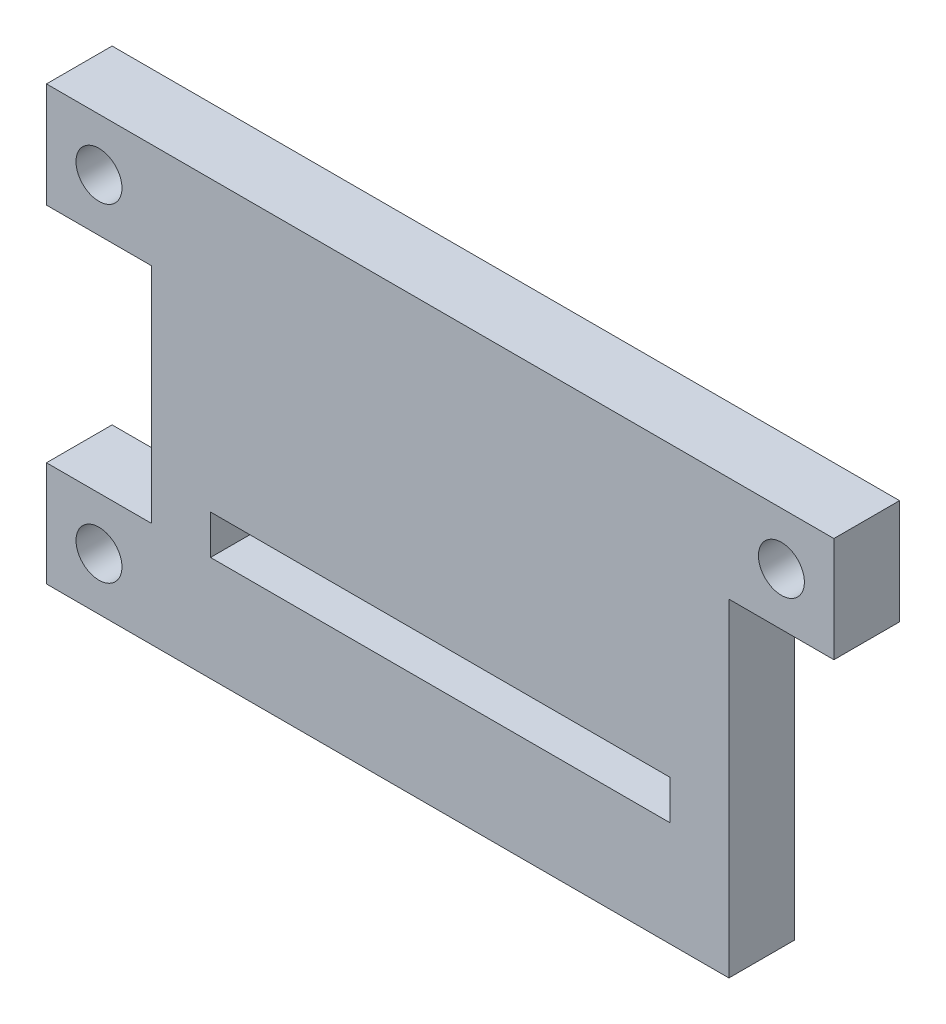
ISO-10303-21;
HEADER;
FILE_DESCRIPTION(('STEP AP214'),'2;1');
FILE_NAME('part.step','',(''),(''),'','','');
FILE_SCHEMA(('AUTOMOTIVE_DESIGN { 1 0 10303 214 1 1 1 1 }'));
ENDSEC;
DATA;
#1=APPLICATION_CONTEXT('core data for automotive mechanical design processes');
#2=APPLICATION_PROTOCOL_DEFINITION('international standard','automotive_design',2000,#1);
#3=PRODUCT_CONTEXT('',#1,'mechanical');
#4=PRODUCT('Part','Part','',(#3));
#5=PRODUCT_RELATED_PRODUCT_CATEGORY('part','',(#4));
#6=PRODUCT_DEFINITION_FORMATION('','',#4);
#7=PRODUCT_DEFINITION_CONTEXT('part definition',#1,'design');
#8=PRODUCT_DEFINITION('design','',#6,#7);
#9=PRODUCT_DEFINITION_SHAPE('','',#8);
#10=(LENGTH_UNIT() NAMED_UNIT(*) SI_UNIT(.MILLI.,.METRE.));
#11=(NAMED_UNIT(*) PLANE_ANGLE_UNIT() SI_UNIT($,.RADIAN.));
#12=(NAMED_UNIT(*) SI_UNIT($,.STERADIAN.) SOLID_ANGLE_UNIT());
#13=UNCERTAINTY_MEASURE_WITH_UNIT(LENGTH_MEASURE(1.E-05),#10,'distance_accuracy_value','');
#14=(GEOMETRIC_REPRESENTATION_CONTEXT(3) GLOBAL_UNCERTAINTY_ASSIGNED_CONTEXT((#13)) GLOBAL_UNIT_ASSIGNED_CONTEXT((#10,
#11,#12)) REPRESENTATION_CONTEXT('',''));
#15=CARTESIAN_POINT('',(0.,0.,0.));
#16=DIRECTION('',(0.,0.,1.));
#17=DIRECTION('',(1.,0.,0.));
#18=AXIS2_PLACEMENT_3D('',#15,#16,#17);
#19=CARTESIAN_POINT('',(0.,-16.5,5.));
#20=DIRECTION('',(0.,1.,0.));
#21=DIRECTION('',(0.,0.,1.));
#22=AXIS2_PLACEMENT_3D('',#19,#20,#21);
#23=PLANE('',#22);
#24=DIRECTION('',(0.,0.,-1.));
#25=VECTOR('',#24,1.);
#26=CARTESIAN_POINT('',(22.,-16.5,5.));
#27=LINE('',#26,#25);
#28=CARTESIAN_POINT('',(22.,-16.5,5.));
#29=VERTEX_POINT('',#28);
#30=CARTESIAN_POINT('',(22.,-16.5,0.));
#31=VERTEX_POINT('',#30);
#32=EDGE_CURVE('E138',#29,#31,#27,.T.);
#33=ORIENTED_EDGE('',*,*,#32,.F.);
#34=DIRECTION('',(1.,0.,0.));
#35=VECTOR('',#34,1.);
#36=CARTESIAN_POINT('',(0.,-16.5,5.));
#37=LINE('',#36,#35);
#38=CARTESIAN_POINT('',(-30.,-16.5,5.));
#39=VERTEX_POINT('',#38);
#40=EDGE_CURVE('E146',#39,#29,#37,.T.);
#41=ORIENTED_EDGE('',*,*,#40,.F.);
#42=DIRECTION('',(0.,0.,-1.));
#43=VECTOR('',#42,1.);
#44=CARTESIAN_POINT('',(-30.,-16.5,5.));
#45=LINE('',#44,#43);
#46=CARTESIAN_POINT('',(-30.,-16.5,0.));
#47=VERTEX_POINT('',#46);
#48=EDGE_CURVE('E214',#39,#47,#45,.T.);
#49=ORIENTED_EDGE('',*,*,#48,.T.);
#50=DIRECTION('',(1.,0.,0.));
#51=VECTOR('',#50,1.);
#52=CARTESIAN_POINT('',(0.,-16.5,0.));
#53=LINE('',#52,#51);
#54=EDGE_CURVE('E151',#47,#31,#53,.T.);
#55=ORIENTED_EDGE('',*,*,#54,.T.);
#56=EDGE_LOOP('',(#33,#41,#49,#55));
#57=FACE_BOUND('',#56,.T.);
#58=ADVANCED_FACE('F35',(#57),#23,.F.);
#59=CARTESIAN_POINT('',(0.,0.,5.));
#60=DIRECTION('',(0.,0.,1.));
#61=DIRECTION('',(1.,0.,0.));
#62=AXIS2_PLACEMENT_3D('',#59,#60,#61);
#63=PLANE('',#62);
#64=CARTESIAN_POINT('',(26.,12.5,5.));
#65=DIRECTION('',(0.,0.,1.));
#66=DIRECTION('',(1.,0.,0.));
#67=AXIS2_PLACEMENT_3D('',#64,#65,#66);
#68=CIRCLE('',#67,1.75);
#69=CARTESIAN_POINT('',(27.75,12.5,5.));
#70=VERTEX_POINT('',#69);
#71=EDGE_CURVE('E170',#70,#70,#68,.T.);
#72=ORIENTED_EDGE('',*,*,#71,.F.);
#73=EDGE_LOOP('',(#72));
#74=FACE_BOUND('',#73,.T.);
#75=CARTESIAN_POINT('',(-26.,-12.5,5.));
#76=DIRECTION('',(0.,0.,1.));
#77=DIRECTION('',(1.,0.,0.));
#78=AXIS2_PLACEMENT_3D('',#75,#76,#77);
#79=CIRCLE('',#78,1.75);
#80=CARTESIAN_POINT('',(-24.25,-12.5,5.));
#81=VERTEX_POINT('',#80);
#82=EDGE_CURVE('E167',#81,#81,#79,.T.);
#83=ORIENTED_EDGE('',*,*,#82,.F.);
#84=EDGE_LOOP('',(#83));
#85=FACE_BOUND('',#84,.T.);
#86=CARTESIAN_POINT('',(-26.,12.5,5.));
#87=DIRECTION('',(0.,0.,1.));
#88=DIRECTION('',(1.,0.,0.));
#89=AXIS2_PLACEMENT_3D('',#86,#87,#88);
#90=CIRCLE('',#89,1.75);
#91=CARTESIAN_POINT('',(-24.25,12.5,5.));
#92=VERTEX_POINT('',#91);
#93=EDGE_CURVE('E209',#92,#92,#90,.T.);
#94=ORIENTED_EDGE('',*,*,#93,.F.);
#95=EDGE_LOOP('',(#94));
#96=FACE_BOUND('',#95,.T.);
#97=DIRECTION('',(0.,1.,0.));
#98=VECTOR('',#97,1.);
#99=CARTESIAN_POINT('',(17.5,-5.49999999999999,5.));
#100=LINE('',#99,#98);
#101=CARTESIAN_POINT('',(17.5,-8.49999999999999,5.));
#102=VERTEX_POINT('',#101);
#103=CARTESIAN_POINT('',(17.5,-5.49999999999999,5.));
#104=VERTEX_POINT('',#103);
#105=EDGE_CURVE('E58',#102,#104,#100,.T.);
#106=ORIENTED_EDGE('',*,*,#105,.F.);
#107=DIRECTION('',(1.,0.,0.));
#108=VECTOR('',#107,1.);
#109=CARTESIAN_POINT('',(-17.5,-8.49999999999999,5.));
#110=LINE('',#109,#108);
#111=CARTESIAN_POINT('',(-17.5,-8.49999999999999,5.));
#112=VERTEX_POINT('',#111);
#113=EDGE_CURVE('E340',#112,#102,#110,.T.);
#114=ORIENTED_EDGE('',*,*,#113,.F.);
#115=DIRECTION('',(0.,-1.,0.));
#116=VECTOR('',#115,1.);
#117=CARTESIAN_POINT('',(-17.5,-5.49999999999999,5.));
#118=LINE('',#117,#116);
#119=CARTESIAN_POINT('',(-17.5,-5.49999999999999,5.));
#120=VERTEX_POINT('',#119);
#121=EDGE_CURVE('E338',#120,#112,#118,.T.);
#122=ORIENTED_EDGE('',*,*,#121,.F.);
#123=DIRECTION('',(-1.,0.,0.));
#124=VECTOR('',#123,1.);
#125=CARTESIAN_POINT('',(-17.5,-5.49999999999999,5.));
#126=LINE('',#125,#124);
#127=EDGE_CURVE('E335',#104,#120,#126,.T.);
#128=ORIENTED_EDGE('',*,*,#127,.F.);
#129=EDGE_LOOP('',(#106,#114,#122,#128));
#130=FACE_BOUND('',#129,.T.);
#131=ORIENTED_EDGE('',*,*,#40,.T.);
#132=DIRECTION('',(0.,-1.,0.));
#133=VECTOR('',#132,1.);
#134=CARTESIAN_POINT('',(22.,0.,5.));
#135=LINE('',#134,#133);
#136=CARTESIAN_POINT('',(22.,8.5,5.));
#137=VERTEX_POINT('',#136);
#138=EDGE_CURVE('E135',#137,#29,#135,.T.);
#139=ORIENTED_EDGE('',*,*,#138,.F.);
#140=DIRECTION('',(-1.,0.,0.));
#141=VECTOR('',#140,1.);
#142=CARTESIAN_POINT('',(0.,8.49999999999999,5.));
#143=LINE('',#142,#141);
#144=CARTESIAN_POINT('',(30.,8.5,5.));
#145=VERTEX_POINT('',#144);
#146=EDGE_CURVE('E145',#145,#137,#143,.T.);
#147=ORIENTED_EDGE('',*,*,#146,.F.);
#148=DIRECTION('',(0.,1.,0.));
#149=VECTOR('',#148,1.);
#150=CARTESIAN_POINT('',(30.,0.,5.));
#151=LINE('',#150,#149);
#152=CARTESIAN_POINT('',(30.,16.5,5.));
#153=VERTEX_POINT('',#152);
#154=EDGE_CURVE('E165',#145,#153,#151,.T.);
#155=ORIENTED_EDGE('',*,*,#154,.T.);
#156=DIRECTION('',(1.,0.,0.));
#157=VECTOR('',#156,1.);
#158=CARTESIAN_POINT('',(0.,16.5,5.));
#159=LINE('',#158,#157);
#160=CARTESIAN_POINT('',(-30.,16.5,5.));
#161=VERTEX_POINT('',#160);
#162=EDGE_CURVE('E248',#161,#153,#159,.T.);
#163=ORIENTED_EDGE('',*,*,#162,.F.);
#164=DIRECTION('',(0.,1.,0.));
#165=VECTOR('',#164,1.);
#166=CARTESIAN_POINT('',(-30.,0.,5.));
#167=LINE('',#166,#165);
#168=CARTESIAN_POINT('',(-30.,8.5,5.));
#169=VERTEX_POINT('',#168);
#170=EDGE_CURVE('E236',#169,#161,#167,.T.);
#171=ORIENTED_EDGE('',*,*,#170,.F.);
#172=DIRECTION('',(1.,0.,0.));
#173=VECTOR('',#172,1.);
#174=CARTESIAN_POINT('',(0.,8.5,5.));
#175=LINE('',#174,#173);
#176=CARTESIAN_POINT('',(-22.,8.5,5.));
#177=VERTEX_POINT('',#176);
#178=EDGE_CURVE('E228',#169,#177,#175,.T.);
#179=ORIENTED_EDGE('',*,*,#178,.T.);
#180=DIRECTION('',(0.,-1.,0.));
#181=VECTOR('',#180,1.);
#182=CARTESIAN_POINT('',(-22.,0.,5.));
#183=LINE('',#182,#181);
#184=CARTESIAN_POINT('',(-22.,-8.49999999999999,5.));
#185=VERTEX_POINT('',#184);
#186=EDGE_CURVE('E257',#177,#185,#183,.T.);
#187=ORIENTED_EDGE('',*,*,#186,.T.);
#188=DIRECTION('',(1.,0.,0.));
#189=VECTOR('',#188,1.);
#190=CARTESIAN_POINT('',(0.,-8.49999999999999,5.));
#191=LINE('',#190,#189);
#192=CARTESIAN_POINT('',(-30.,-8.49999999999999,5.));
#193=VERTEX_POINT('',#192);
#194=EDGE_CURVE('E160',#193,#185,#191,.T.);
#195=ORIENTED_EDGE('',*,*,#194,.F.);
#196=DIRECTION('',(0.,-1.,0.));
#197=VECTOR('',#196,1.);
#198=CARTESIAN_POINT('',(-30.,0.,5.));
#199=LINE('',#198,#197);
#200=EDGE_CURVE('E157',#193,#39,#199,.T.);
#201=ORIENTED_EDGE('',*,*,#200,.T.);
#202=EDGE_LOOP('',(#131,#139,#147,#155,#163,#171,#179,#187,#195,#201));
#203=FACE_BOUND('',#202,.T.);
#204=ADVANCED_FACE('F154',(#74,#85,#96,#130,#203),#63,.T.);
#205=CARTESIAN_POINT('',(0.,0.,0.));
#206=DIRECTION('',(0.,0.,1.));
#207=DIRECTION('',(1.,0.,0.));
#208=AXIS2_PLACEMENT_3D('',#205,#206,#207);
#209=PLANE('',#208);
#210=CARTESIAN_POINT('',(26.,12.5,0.));
#211=DIRECTION('',(0.,0.,1.));
#212=DIRECTION('',(1.,0.,0.));
#213=AXIS2_PLACEMENT_3D('',#210,#211,#212);
#214=CIRCLE('',#213,1.75);
#215=CARTESIAN_POINT('',(27.75,12.5,0.));
#216=VERTEX_POINT('',#215);
#217=EDGE_CURVE('E206',#216,#216,#214,.T.);
#218=ORIENTED_EDGE('',*,*,#217,.T.);
#219=EDGE_LOOP('',(#218));
#220=FACE_BOUND('',#219,.T.);
#221=CARTESIAN_POINT('',(-26.,-12.5,0.));
#222=DIRECTION('',(0.,0.,1.));
#223=DIRECTION('',(1.,0.,0.));
#224=AXIS2_PLACEMENT_3D('',#221,#222,#223);
#225=CIRCLE('',#224,1.75);
#226=CARTESIAN_POINT('',(-24.25,-12.5,0.));
#227=VERTEX_POINT('',#226);
#228=EDGE_CURVE('E203',#227,#227,#225,.T.);
#229=ORIENTED_EDGE('',*,*,#228,.T.);
#230=EDGE_LOOP('',(#229));
#231=FACE_BOUND('',#230,.T.);
#232=CARTESIAN_POINT('',(-26.,12.5,0.));
#233=DIRECTION('',(0.,0.,1.));
#234=DIRECTION('',(1.,0.,0.));
#235=AXIS2_PLACEMENT_3D('',#232,#233,#234);
#236=CIRCLE('',#235,1.75);
#237=CARTESIAN_POINT('',(-24.25,12.5,0.));
#238=VERTEX_POINT('',#237);
#239=EDGE_CURVE('E174',#238,#238,#236,.T.);
#240=ORIENTED_EDGE('',*,*,#239,.T.);
#241=EDGE_LOOP('',(#240));
#242=FACE_BOUND('',#241,.T.);
#243=DIRECTION('',(-1.,0.,0.));
#244=VECTOR('',#243,1.);
#245=CARTESIAN_POINT('',(-17.5,-8.49999999999999,0.));
#246=LINE('',#245,#244);
#247=CARTESIAN_POINT('',(17.5,-8.49999999999999,0.));
#248=VERTEX_POINT('',#247);
#249=CARTESIAN_POINT('',(-17.5,-8.49999999999999,0.));
#250=VERTEX_POINT('',#249);
#251=EDGE_CURVE('E317',#248,#250,#246,.T.);
#252=ORIENTED_EDGE('',*,*,#251,.F.);
#253=DIRECTION('',(0.,-1.,0.));
#254=VECTOR('',#253,1.);
#255=CARTESIAN_POINT('',(17.5,-5.49999999999999,0.));
#256=LINE('',#255,#254);
#257=CARTESIAN_POINT('',(17.5,-5.49999999999999,0.));
#258=VERTEX_POINT('',#257);
#259=EDGE_CURVE('E326',#258,#248,#256,.T.);
#260=ORIENTED_EDGE('',*,*,#259,.F.);
#261=DIRECTION('',(1.,0.,0.));
#262=VECTOR('',#261,1.);
#263=CARTESIAN_POINT('',(-17.5,-5.49999999999999,0.));
#264=LINE('',#263,#262);
#265=CARTESIAN_POINT('',(-17.5,-5.49999999999999,0.));
#266=VERTEX_POINT('',#265);
#267=EDGE_CURVE('E178',#266,#258,#264,.T.);
#268=ORIENTED_EDGE('',*,*,#267,.F.);
#269=DIRECTION('',(0.,1.,0.));
#270=VECTOR('',#269,1.);
#271=CARTESIAN_POINT('',(-17.5,-5.49999999999999,0.));
#272=LINE('',#271,#270);
#273=EDGE_CURVE('E152',#250,#266,#272,.T.);
#274=ORIENTED_EDGE('',*,*,#273,.F.);
#275=EDGE_LOOP('',(#252,#260,#268,#274));
#276=FACE_BOUND('',#275,.T.);
#277=DIRECTION('',(0.,-1.,0.));
#278=VECTOR('',#277,1.);
#279=CARTESIAN_POINT('',(22.,0.,0.));
#280=LINE('',#279,#278);
#281=CARTESIAN_POINT('',(22.,8.5,0.));
#282=VERTEX_POINT('',#281);
#283=EDGE_CURVE('E50',#282,#31,#280,.T.);
#284=ORIENTED_EDGE('',*,*,#283,.T.);
#285=ORIENTED_EDGE('',*,*,#54,.F.);
#286=DIRECTION('',(0.,-1.,0.));
#287=VECTOR('',#286,1.);
#288=CARTESIAN_POINT('',(-30.,0.,0.));
#289=LINE('',#288,#287);
#290=CARTESIAN_POINT('',(-30.,-8.49999999999999,0.));
#291=VERTEX_POINT('',#290);
#292=EDGE_CURVE('E193',#291,#47,#289,.T.);
#293=ORIENTED_EDGE('',*,*,#292,.F.);
#294=DIRECTION('',(1.,0.,0.));
#295=VECTOR('',#294,1.);
#296=CARTESIAN_POINT('',(0.,-8.49999999999999,0.));
#297=LINE('',#296,#295);
#298=CARTESIAN_POINT('',(-22.,-8.49999999999999,0.));
#299=VERTEX_POINT('',#298);
#300=EDGE_CURVE('E190',#291,#299,#297,.T.);
#301=ORIENTED_EDGE('',*,*,#300,.T.);
#302=DIRECTION('',(0.,-1.,0.));
#303=VECTOR('',#302,1.);
#304=CARTESIAN_POINT('',(-22.,0.,0.));
#305=LINE('',#304,#303);
#306=CARTESIAN_POINT('',(-22.,8.5,0.));
#307=VERTEX_POINT('',#306);
#308=EDGE_CURVE('E187',#307,#299,#305,.T.);
#309=ORIENTED_EDGE('',*,*,#308,.F.);
#310=DIRECTION('',(1.,0.,0.));
#311=VECTOR('',#310,1.);
#312=CARTESIAN_POINT('',(0.,8.5,0.));
#313=LINE('',#312,#311);
#314=CARTESIAN_POINT('',(-30.,8.5,0.));
#315=VERTEX_POINT('',#314);
#316=EDGE_CURVE('E184',#315,#307,#313,.T.);
#317=ORIENTED_EDGE('',*,*,#316,.F.);
#318=DIRECTION('',(0.,1.,0.));
#319=VECTOR('',#318,1.);
#320=CARTESIAN_POINT('',(-30.,0.,0.));
#321=LINE('',#320,#319);
#322=CARTESIAN_POINT('',(-30.,16.5,0.));
#323=VERTEX_POINT('',#322);
#324=EDGE_CURVE('E181',#315,#323,#321,.T.);
#325=ORIENTED_EDGE('',*,*,#324,.T.);
#326=DIRECTION('',(1.,0.,0.));
#327=VECTOR('',#326,1.);
#328=CARTESIAN_POINT('',(0.,16.5,0.));
#329=LINE('',#328,#327);
#330=CARTESIAN_POINT('',(30.,16.5,0.));
#331=VERTEX_POINT('',#330);
#332=EDGE_CURVE('E177',#323,#331,#329,.T.);
#333=ORIENTED_EDGE('',*,*,#332,.T.);
#334=DIRECTION('',(0.,1.,0.));
#335=VECTOR('',#334,1.);
#336=CARTESIAN_POINT('',(30.,0.,0.));
#337=LINE('',#336,#335);
#338=CARTESIAN_POINT('',(30.,8.5,0.));
#339=VERTEX_POINT('',#338);
#340=EDGE_CURVE('E200',#339,#331,#337,.T.);
#341=ORIENTED_EDGE('',*,*,#340,.F.);
#342=DIRECTION('',(-1.,0.,0.));
#343=VECTOR('',#342,1.);
#344=CARTESIAN_POINT('',(0.,8.49999999999999,0.));
#345=LINE('',#344,#343);
#346=EDGE_CURVE('E198',#339,#282,#345,.T.);
#347=ORIENTED_EDGE('',*,*,#346,.T.);
#348=EDGE_LOOP('',(#284,#285,#293,#301,#309,#317,#325,#333,#341,#347));
#349=FACE_BOUND('',#348,.T.);
#350=ADVANCED_FACE('F233',(#220,#231,#242,#276,#349),#209,.F.);
#351=CARTESIAN_POINT('',(0.,16.5,5.));
#352=DIRECTION('',(0.,1.,0.));
#353=DIRECTION('',(0.,0.,1.));
#354=AXIS2_PLACEMENT_3D('',#351,#352,#353);
#355=PLANE('',#354);
#356=ORIENTED_EDGE('',*,*,#332,.F.);
#357=DIRECTION('',(0.,0.,-1.));
#358=VECTOR('',#357,1.);
#359=CARTESIAN_POINT('',(-30.,16.5,5.));
#360=LINE('',#359,#358);
#361=EDGE_CURVE('E11',#161,#323,#360,.T.);
#362=ORIENTED_EDGE('',*,*,#361,.F.);
#363=ORIENTED_EDGE('',*,*,#162,.T.);
#364=DIRECTION('',(0.,0.,-1.));
#365=VECTOR('',#364,1.);
#366=CARTESIAN_POINT('',(30.,16.5,5.));
#367=LINE('',#366,#365);
#368=EDGE_CURVE('E173',#153,#331,#367,.T.);
#369=ORIENTED_EDGE('',*,*,#368,.T.);
#370=EDGE_LOOP('',(#356,#362,#363,#369));
#371=FACE_BOUND('',#370,.T.);
#372=ADVANCED_FACE('F240',(#371),#355,.T.);
#373=CARTESIAN_POINT('',(-30.,0.,5.));
#374=DIRECTION('',(-1.,0.,0.));
#375=DIRECTION('',(0.,-1.,0.));
#376=AXIS2_PLACEMENT_3D('',#373,#374,#375);
#377=PLANE('',#376);
#378=ORIENTED_EDGE('',*,*,#324,.F.);
#379=DIRECTION('',(0.,0.,-1.));
#380=VECTOR('',#379,1.);
#381=CARTESIAN_POINT('',(-30.,8.5,5.));
#382=LINE('',#381,#380);
#383=EDGE_CURVE('E43',#169,#315,#382,.T.);
#384=ORIENTED_EDGE('',*,*,#383,.F.);
#385=ORIENTED_EDGE('',*,*,#170,.T.);
#386=ORIENTED_EDGE('',*,*,#361,.T.);
#387=EDGE_LOOP('',(#378,#384,#385,#386));
#388=FACE_BOUND('',#387,.T.);
#389=ADVANCED_FACE('F234',(#388),#377,.T.);
#390=CARTESIAN_POINT('',(0.,8.5,5.));
#391=DIRECTION('',(0.,1.,0.));
#392=DIRECTION('',(0.,0.,1.));
#393=AXIS2_PLACEMENT_3D('',#390,#391,#392);
#394=PLANE('',#393);
#395=ORIENTED_EDGE('',*,*,#316,.T.);
#396=DIRECTION('',(0.,0.,-1.));
#397=VECTOR('',#396,1.);
#398=CARTESIAN_POINT('',(-22.,8.5,5.));
#399=LINE('',#398,#397);
#400=EDGE_CURVE('E220',#177,#307,#399,.T.);
#401=ORIENTED_EDGE('',*,*,#400,.F.);
#402=ORIENTED_EDGE('',*,*,#178,.F.);
#403=ORIENTED_EDGE('',*,*,#383,.T.);
#404=EDGE_LOOP('',(#395,#401,#402,#403));
#405=FACE_BOUND('',#404,.T.);
#406=ADVANCED_FACE('F225',(#405),#394,.F.);
#407=CARTESIAN_POINT('',(-22.,0.,5.));
#408=DIRECTION('',(1.,0.,0.));
#409=DIRECTION('',(0.,0.,-1.));
#410=AXIS2_PLACEMENT_3D('',#407,#408,#409);
#411=PLANE('',#410);
#412=ORIENTED_EDGE('',*,*,#308,.T.);
#413=DIRECTION('',(0.,0.,-1.));
#414=VECTOR('',#413,1.);
#415=CARTESIAN_POINT('',(-22.,-8.49999999999999,5.));
#416=LINE('',#415,#414);
#417=EDGE_CURVE('E218',#185,#299,#416,.T.);
#418=ORIENTED_EDGE('',*,*,#417,.F.);
#419=ORIENTED_EDGE('',*,*,#186,.F.);
#420=ORIENTED_EDGE('',*,*,#400,.T.);
#421=EDGE_LOOP('',(#412,#418,#419,#420));
#422=FACE_BOUND('',#421,.T.);
#423=ADVANCED_FACE('F264',(#422),#411,.F.);
#424=CARTESIAN_POINT('',(0.,-8.49999999999999,5.));
#425=DIRECTION('',(0.,1.,0.));
#426=DIRECTION('',(0.,0.,1.));
#427=AXIS2_PLACEMENT_3D('',#424,#425,#426);
#428=PLANE('',#427);
#429=ORIENTED_EDGE('',*,*,#300,.F.);
#430=DIRECTION('',(0.,0.,-1.));
#431=VECTOR('',#430,1.);
#432=CARTESIAN_POINT('',(-30.,-8.49999999999999,5.));
#433=LINE('',#432,#431);
#434=EDGE_CURVE('E216',#193,#291,#433,.T.);
#435=ORIENTED_EDGE('',*,*,#434,.F.);
#436=ORIENTED_EDGE('',*,*,#194,.T.);
#437=ORIENTED_EDGE('',*,*,#417,.T.);
#438=EDGE_LOOP('',(#429,#435,#436,#437));
#439=FACE_BOUND('',#438,.T.);
#440=ADVANCED_FACE('F261',(#439),#428,.T.);
#441=CARTESIAN_POINT('',(-30.,0.,5.));
#442=DIRECTION('',(1.,0.,0.));
#443=DIRECTION('',(0.,1.,0.));
#444=AXIS2_PLACEMENT_3D('',#441,#442,#443);
#445=PLANE('',#444);
#446=ORIENTED_EDGE('',*,*,#292,.T.);
#447=ORIENTED_EDGE('',*,*,#48,.F.);
#448=ORIENTED_EDGE('',*,*,#200,.F.);
#449=ORIENTED_EDGE('',*,*,#434,.T.);
#450=EDGE_LOOP('',(#446,#447,#448,#449));
#451=FACE_BOUND('',#450,.T.);
#452=ADVANCED_FACE('F267',(#451),#445,.F.);
#453=CARTESIAN_POINT('',(22.,0.,5.));
#454=DIRECTION('',(1.,0.,0.));
#455=DIRECTION('',(0.,0.,-1.));
#456=AXIS2_PLACEMENT_3D('',#453,#454,#455);
#457=PLANE('',#456);
#458=ORIENTED_EDGE('',*,*,#283,.F.);
#459=DIRECTION('',(0.,0.,-1.));
#460=VECTOR('',#459,1.);
#461=CARTESIAN_POINT('',(22.,8.5,5.));
#462=LINE('',#461,#460);
#463=EDGE_CURVE('E140',#137,#282,#462,.T.);
#464=ORIENTED_EDGE('',*,*,#463,.F.);
#465=ORIENTED_EDGE('',*,*,#138,.T.);
#466=ORIENTED_EDGE('',*,*,#32,.T.);
#467=EDGE_LOOP('',(#458,#464,#465,#466));
#468=FACE_BOUND('',#467,.T.);
#469=ADVANCED_FACE('F137',(#468),#457,.T.);
#470=CARTESIAN_POINT('',(0.,8.49999999999999,5.));
#471=DIRECTION('',(0.,-1.,0.));
#472=DIRECTION('',(1.,0.,0.));
#473=AXIS2_PLACEMENT_3D('',#470,#471,#472);
#474=PLANE('',#473);
#475=ORIENTED_EDGE('',*,*,#346,.F.);
#476=DIRECTION('',(0.,0.,-1.));
#477=VECTOR('',#476,1.);
#478=CARTESIAN_POINT('',(30.,8.5,5.));
#479=LINE('',#478,#477);
#480=EDGE_CURVE('E211',#145,#339,#479,.T.);
#481=ORIENTED_EDGE('',*,*,#480,.F.);
#482=ORIENTED_EDGE('',*,*,#146,.T.);
#483=ORIENTED_EDGE('',*,*,#463,.T.);
#484=EDGE_LOOP('',(#475,#481,#482,#483));
#485=FACE_BOUND('',#484,.T.);
#486=ADVANCED_FACE('F246',(#485),#474,.T.);
#487=CARTESIAN_POINT('',(-26.,-12.5,5.));
#488=DIRECTION('',(0.,0.,-1.));
#489=DIRECTION('',(-1.,0.,0.));
#490=AXIS2_PLACEMENT_3D('',#487,#488,#489);
#491=CYLINDRICAL_SURFACE('',#490,1.75);
#492=ORIENTED_EDGE('',*,*,#82,.T.);
#493=EDGE_LOOP('',(#492));
#494=FACE_BOUND('',#493,.T.);
#495=ORIENTED_EDGE('',*,*,#228,.F.);
#496=EDGE_LOOP('',(#495));
#497=FACE_BOUND('',#496,.T.);
#498=ADVANCED_FACE('F286',(#494,#497),#491,.F.);
#499=CARTESIAN_POINT('',(30.,0.,5.));
#500=DIRECTION('',(-1.,0.,0.));
#501=DIRECTION('',(0.,0.,1.));
#502=AXIS2_PLACEMENT_3D('',#499,#500,#501);
#503=PLANE('',#502);
#504=ORIENTED_EDGE('',*,*,#340,.T.);
#505=ORIENTED_EDGE('',*,*,#368,.F.);
#506=ORIENTED_EDGE('',*,*,#154,.F.);
#507=ORIENTED_EDGE('',*,*,#480,.T.);
#508=EDGE_LOOP('',(#504,#505,#506,#507));
#509=FACE_BOUND('',#508,.T.);
#510=ADVANCED_FACE('F249',(#509),#503,.F.);
#511=CARTESIAN_POINT('',(-26.,12.5,5.));
#512=DIRECTION('',(0.,0.,-1.));
#513=DIRECTION('',(-1.,0.,0.));
#514=AXIS2_PLACEMENT_3D('',#511,#512,#513);
#515=CYLINDRICAL_SURFACE('',#514,1.75);
#516=ORIENTED_EDGE('',*,*,#93,.T.);
#517=EDGE_LOOP('',(#516));
#518=FACE_BOUND('',#517,.T.);
#519=ORIENTED_EDGE('',*,*,#239,.F.);
#520=EDGE_LOOP('',(#519));
#521=FACE_BOUND('',#520,.T.);
#522=ADVANCED_FACE('F37',(#518,#521),#515,.F.);
#523=CARTESIAN_POINT('',(26.,12.5,5.));
#524=DIRECTION('',(0.,0.,-1.));
#525=DIRECTION('',(-1.,0.,0.));
#526=AXIS2_PLACEMENT_3D('',#523,#524,#525);
#527=CYLINDRICAL_SURFACE('',#526,1.75);
#528=ORIENTED_EDGE('',*,*,#71,.T.);
#529=EDGE_LOOP('',(#528));
#530=FACE_BOUND('',#529,.T.);
#531=ORIENTED_EDGE('',*,*,#217,.F.);
#532=EDGE_LOOP('',(#531));
#533=FACE_BOUND('',#532,.T.);
#534=ADVANCED_FACE('F292',(#530,#533),#527,.F.);
#535=CARTESIAN_POINT('',(17.5,-5.49999999999999,-0.00100000000000013));
#536=DIRECTION('',(1.,0.,0.));
#537=DIRECTION('',(0.,0.,-1.));
#538=AXIS2_PLACEMENT_3D('',#535,#536,#537);
#539=PLANE('',#538);
#540=ORIENTED_EDGE('',*,*,#259,.T.);
#541=DIRECTION('',(0.,0.,1.));
#542=VECTOR('',#541,1.);
#543=CARTESIAN_POINT('',(17.5,-8.49999999999999,-0.00100000000000013));
#544=LINE('',#543,#542);
#545=EDGE_CURVE('E322',#248,#102,#544,.T.);
#546=ORIENTED_EDGE('',*,*,#545,.T.);
#547=ORIENTED_EDGE('',*,*,#105,.T.);
#548=DIRECTION('',(0.,0.,1.));
#549=VECTOR('',#548,1.);
#550=CARTESIAN_POINT('',(17.5,-5.49999999999999,-0.00100000000000013));
#551=LINE('',#550,#549);
#552=EDGE_CURVE('E342',#258,#104,#551,.T.);
#553=ORIENTED_EDGE('',*,*,#552,.F.);
#554=EDGE_LOOP('',(#540,#546,#547,#553));
#555=FACE_BOUND('',#554,.T.);
#556=ADVANCED_FACE('F295',(#555),#539,.F.);
#557=CARTESIAN_POINT('',(-17.5,-8.49999999999999,-0.00100000000000013));
#558=DIRECTION('',(0.,-1.,0.));
#559=DIRECTION('',(0.,0.,-1.));
#560=AXIS2_PLACEMENT_3D('',#557,#558,#559);
#561=PLANE('',#560);
#562=ORIENTED_EDGE('',*,*,#251,.T.);
#563=DIRECTION('',(0.,0.,1.));
#564=VECTOR('',#563,1.);
#565=CARTESIAN_POINT('',(-17.5,-8.49999999999999,-0.00100000000000013));
#566=LINE('',#565,#564);
#567=EDGE_CURVE('E320',#250,#112,#566,.T.);
#568=ORIENTED_EDGE('',*,*,#567,.T.);
#569=ORIENTED_EDGE('',*,*,#113,.T.);
#570=ORIENTED_EDGE('',*,*,#545,.F.);
#571=EDGE_LOOP('',(#562,#568,#569,#570));
#572=FACE_BOUND('',#571,.T.);
#573=ADVANCED_FACE('F302',(#572),#561,.F.);
#574=CARTESIAN_POINT('',(-17.5,-5.49999999999999,-0.00100000000000013));
#575=DIRECTION('',(-1.,0.,0.));
#576=DIRECTION('',(0.,0.,1.));
#577=AXIS2_PLACEMENT_3D('',#574,#575,#576);
#578=PLANE('',#577);
#579=ORIENTED_EDGE('',*,*,#273,.T.);
#580=DIRECTION('',(0.,0.,1.));
#581=VECTOR('',#580,1.);
#582=CARTESIAN_POINT('',(-17.5,-5.49999999999999,-0.00100000000000013));
#583=LINE('',#582,#581);
#584=EDGE_CURVE('E345',#266,#120,#583,.T.);
#585=ORIENTED_EDGE('',*,*,#584,.T.);
#586=ORIENTED_EDGE('',*,*,#121,.T.);
#587=ORIENTED_EDGE('',*,*,#567,.F.);
#588=EDGE_LOOP('',(#579,#585,#586,#587));
#589=FACE_BOUND('',#588,.T.);
#590=ADVANCED_FACE('F306',(#589),#578,.F.);
#591=CARTESIAN_POINT('',(-17.5,-5.49999999999999,-0.00100000000000013));
#592=DIRECTION('',(0.,1.,0.));
#593=DIRECTION('',(0.,0.,1.));
#594=AXIS2_PLACEMENT_3D('',#591,#592,#593);
#595=PLANE('',#594);
#596=ORIENTED_EDGE('',*,*,#267,.T.);
#597=ORIENTED_EDGE('',*,*,#552,.T.);
#598=ORIENTED_EDGE('',*,*,#127,.T.);
#599=ORIENTED_EDGE('',*,*,#584,.F.);
#600=EDGE_LOOP('',(#596,#597,#598,#599));
#601=FACE_BOUND('',#600,.T.);
#602=ADVANCED_FACE('F303',(#601),#595,.F.);
#603=CLOSED_SHELL('',(#58,#204,#350,#372,#389,#406,#423,#440,#452,#469,#486,#498,#510,#522,#534,
#556,#573,#590,#602));
#604=MANIFOLD_SOLID_BREP('B2',#603);
#605=ADVANCED_BREP_SHAPE_REPRESENTATION('',(#18,#604),#14);
#606=SHAPE_DEFINITION_REPRESENTATION(#9,#605);
ENDSEC;
END-ISO-10303-21;
